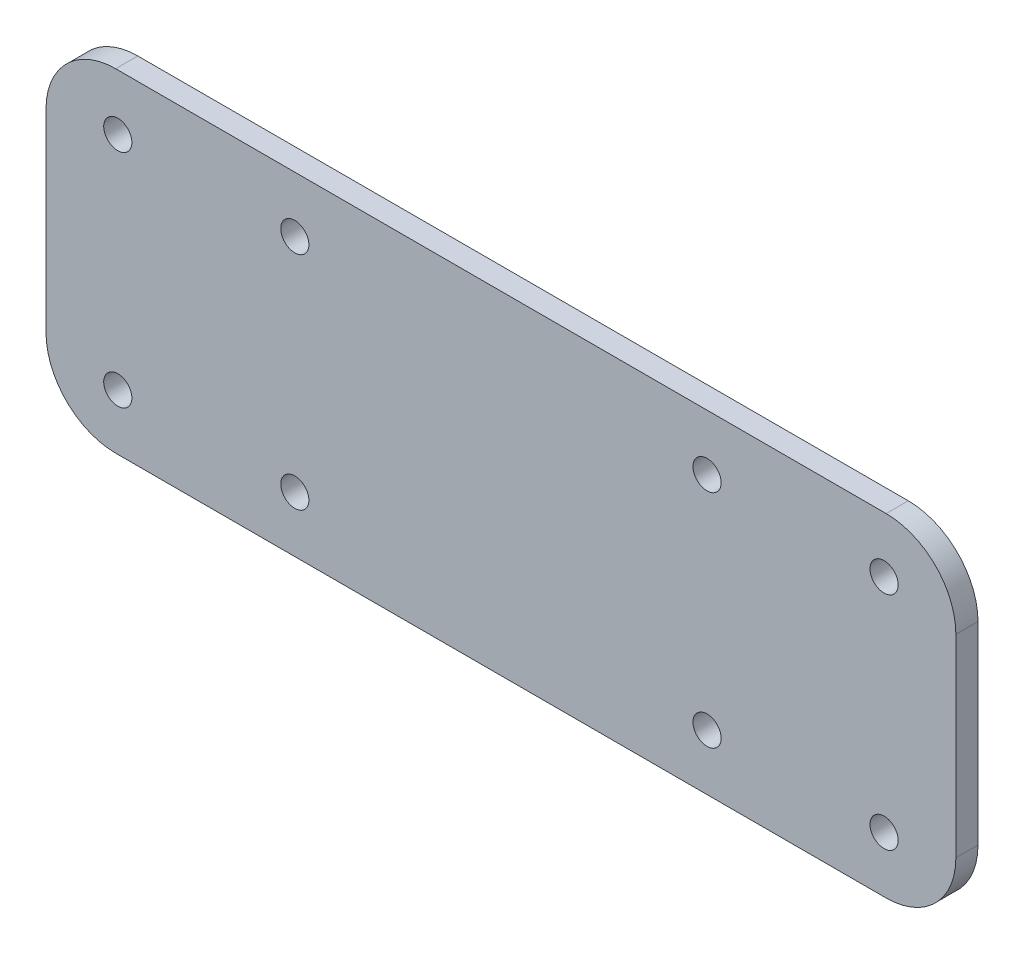
ISO-10303-21;
HEADER;
FILE_DESCRIPTION(('STEP AP214'),'2;1');
FILE_NAME('part.step','',(''),(''),'','','');
FILE_SCHEMA(('AUTOMOTIVE_DESIGN { 1 0 10303 214 1 1 1 1 }'));
ENDSEC;
DATA;
#1=APPLICATION_CONTEXT('core data for automotive mechanical design processes');
#2=APPLICATION_PROTOCOL_DEFINITION('international standard','automotive_design',2000,#1);
#3=PRODUCT_CONTEXT('',#1,'mechanical');
#4=PRODUCT('Part','Part','',(#3));
#5=PRODUCT_RELATED_PRODUCT_CATEGORY('part','',(#4));
#6=PRODUCT_DEFINITION_FORMATION('','',#4);
#7=PRODUCT_DEFINITION_CONTEXT('part definition',#1,'design');
#8=PRODUCT_DEFINITION('design','',#6,#7);
#9=PRODUCT_DEFINITION_SHAPE('','',#8);
#10=(LENGTH_UNIT() NAMED_UNIT(*) SI_UNIT(.MILLI.,.METRE.));
#11=(NAMED_UNIT(*) PLANE_ANGLE_UNIT() SI_UNIT($,.RADIAN.));
#12=(NAMED_UNIT(*) SI_UNIT($,.STERADIAN.) SOLID_ANGLE_UNIT());
#13=UNCERTAINTY_MEASURE_WITH_UNIT(LENGTH_MEASURE(1.E-05),#10,'distance_accuracy_value','');
#14=(GEOMETRIC_REPRESENTATION_CONTEXT(3) GLOBAL_UNCERTAINTY_ASSIGNED_CONTEXT((#13)) GLOBAL_UNIT_ASSIGNED_CONTEXT((#10,
#11,#12)) REPRESENTATION_CONTEXT('',''));
#15=CARTESIAN_POINT('',(0.,0.,0.));
#16=DIRECTION('',(0.,0.,1.));
#17=DIRECTION('',(1.,0.,0.));
#18=AXIS2_PLACEMENT_3D('',#15,#16,#17);
#19=CARTESIAN_POINT('',(157.634536959179,-46.40005,3.175));
#20=DIRECTION('',(0.,0.,-1.));
#21=DIRECTION('',(-1.,0.,0.));
#22=AXIS2_PLACEMENT_3D('',#19,#20,#21);
#23=CYLINDRICAL_SURFACE('',#22,2.0193);
#24=CARTESIAN_POINT('',(157.634536959179,-46.40005,3.175));
#25=DIRECTION('',(0.,0.,1.));
#26=DIRECTION('',(1.,0.,0.));
#27=AXIS2_PLACEMENT_3D('',#24,#25,#26);
#28=CIRCLE('',#27,2.0193);
#29=CARTESIAN_POINT('',(159.653836959179,-46.40005,3.175));
#30=VERTEX_POINT('',#29);
#31=EDGE_CURVE('E149',#30,#30,#28,.T.);
#32=ORIENTED_EDGE('',*,*,#31,.F.);
#33=EDGE_LOOP('',(#32));
#34=FACE_BOUND('',#33,.T.);
#35=CARTESIAN_POINT('',(157.634536959179,-46.40005,6.35));
#36=DIRECTION('',(0.,0.,1.));
#37=DIRECTION('',(1.,0.,0.));
#38=AXIS2_PLACEMENT_3D('',#35,#36,#37);
#39=CIRCLE('',#38,2.0193);
#40=CARTESIAN_POINT('',(159.653836959179,-46.40005,6.35));
#41=VERTEX_POINT('',#40);
#42=EDGE_CURVE('E119',#41,#41,#39,.F.);
#43=ORIENTED_EDGE('',*,*,#42,.F.);
#44=EDGE_LOOP('',(#43));
#45=FACE_BOUND('',#44,.T.);
#46=ADVANCED_FACE('F36',(#34,#45),#23,.F.);
#47=CARTESIAN_POINT('',(157.634536959179,-14.65005,3.175));
#48=DIRECTION('',(0.,0.,-1.));
#49=DIRECTION('',(-1.,0.,0.));
#50=AXIS2_PLACEMENT_3D('',#47,#48,#49);
#51=CYLINDRICAL_SURFACE('',#50,2.01929999999999);
#52=CARTESIAN_POINT('',(157.634536959179,-14.65005,3.175));
#53=DIRECTION('',(0.,0.,1.));
#54=DIRECTION('',(1.,0.,0.));
#55=AXIS2_PLACEMENT_3D('',#52,#53,#54);
#56=CIRCLE('',#55,2.01929999999999);
#57=CARTESIAN_POINT('',(159.653836959179,-14.65005,3.175));
#58=VERTEX_POINT('',#57);
#59=EDGE_CURVE('E209',#58,#58,#56,.T.);
#60=ORIENTED_EDGE('',*,*,#59,.F.);
#61=EDGE_LOOP('',(#60));
#62=FACE_BOUND('',#61,.T.);
#63=CARTESIAN_POINT('',(157.634536959179,-14.65005,6.35));
#64=DIRECTION('',(0.,0.,1.));
#65=DIRECTION('',(1.,0.,0.));
#66=AXIS2_PLACEMENT_3D('',#63,#64,#65);
#67=CIRCLE('',#66,2.01929999999999);
#68=CARTESIAN_POINT('',(159.653836959179,-14.65005,6.35));
#69=VERTEX_POINT('',#68);
#70=EDGE_CURVE('E137',#69,#69,#67,.F.);
#71=ORIENTED_EDGE('',*,*,#70,.F.);
#72=EDGE_LOOP('',(#71));
#73=FACE_BOUND('',#72,.T.);
#74=ADVANCED_FACE('F241',(#62,#73),#51,.F.);
#75=CARTESIAN_POINT('',(73.085367228118,-14.65005,3.175));
#76=DIRECTION('',(0.,0.,-1.));
#77=DIRECTION('',(-1.,0.,0.));
#78=AXIS2_PLACEMENT_3D('',#75,#76,#77);
#79=CYLINDRICAL_SURFACE('',#78,2.01929999999999);
#80=CARTESIAN_POINT('',(73.085367228118,-14.65005,3.175));
#81=DIRECTION('',(0.,0.,1.));
#82=DIRECTION('',(1.,0.,0.));
#83=AXIS2_PLACEMENT_3D('',#80,#81,#82);
#84=CIRCLE('',#83,2.01929999999999);
#85=CARTESIAN_POINT('',(75.104667228118,-14.65005,3.175));
#86=VERTEX_POINT('',#85);
#87=EDGE_CURVE('E206',#86,#86,#84,.T.);
#88=ORIENTED_EDGE('',*,*,#87,.F.);
#89=EDGE_LOOP('',(#88));
#90=FACE_BOUND('',#89,.T.);
#91=CARTESIAN_POINT('',(73.085367228118,-14.65005,6.35));
#92=DIRECTION('',(0.,0.,1.));
#93=DIRECTION('',(1.,0.,0.));
#94=AXIS2_PLACEMENT_3D('',#91,#92,#93);
#95=CIRCLE('',#94,2.01929999999999);
#96=CARTESIAN_POINT('',(75.104667228118,-14.65005,6.35));
#97=VERTEX_POINT('',#96);
#98=EDGE_CURVE('E140',#97,#97,#95,.F.);
#99=ORIENTED_EDGE('',*,*,#98,.F.);
#100=EDGE_LOOP('',(#99));
#101=FACE_BOUND('',#100,.T.);
#102=ADVANCED_FACE('F247',(#90,#101),#79,.F.);
#103=CARTESIAN_POINT('',(73.085367228118,-46.40005,3.175));
#104=DIRECTION('',(0.,0.,-1.));
#105=DIRECTION('',(-1.,0.,0.));
#106=AXIS2_PLACEMENT_3D('',#103,#104,#105);
#107=CYLINDRICAL_SURFACE('',#106,2.0193);
#108=CARTESIAN_POINT('',(73.085367228118,-46.40005,3.175));
#109=DIRECTION('',(0.,0.,1.));
#110=DIRECTION('',(1.,0.,0.));
#111=AXIS2_PLACEMENT_3D('',#108,#109,#110);
#112=CIRCLE('',#111,2.0193);
#113=CARTESIAN_POINT('',(75.104667228118,-46.40005,3.175));
#114=VERTEX_POINT('',#113);
#115=EDGE_CURVE('E203',#114,#114,#112,.T.);
#116=ORIENTED_EDGE('',*,*,#115,.F.);
#117=EDGE_LOOP('',(#116));
#118=FACE_BOUND('',#117,.T.);
#119=CARTESIAN_POINT('',(73.085367228118,-46.40005,6.35));
#120=DIRECTION('',(0.,0.,1.));
#121=DIRECTION('',(1.,0.,0.));
#122=AXIS2_PLACEMENT_3D('',#119,#120,#121);
#123=CIRCLE('',#122,2.0193);
#124=CARTESIAN_POINT('',(75.104667228118,-46.40005,6.35));
#125=VERTEX_POINT('',#124);
#126=EDGE_CURVE('E125',#125,#125,#123,.F.);
#127=ORIENTED_EDGE('',*,*,#126,.F.);
#128=EDGE_LOOP('',(#127));
#129=FACE_BOUND('',#128,.T.);
#130=ADVANCED_FACE('F258',(#118,#129),#107,.F.);
#131=CARTESIAN_POINT('',(47.685367228118,-46.40005,3.175));
#132=DIRECTION('',(0.,0.,-1.));
#133=DIRECTION('',(-1.,0.,0.));
#134=AXIS2_PLACEMENT_3D('',#131,#132,#133);
#135=CYLINDRICAL_SURFACE('',#134,2.01929999999999);
#136=CARTESIAN_POINT('',(47.685367228118,-46.40005,3.175));
#137=DIRECTION('',(0.,0.,1.));
#138=DIRECTION('',(1.,0.,0.));
#139=AXIS2_PLACEMENT_3D('',#136,#137,#138);
#140=CIRCLE('',#139,2.01929999999999);
#141=CARTESIAN_POINT('',(49.704667228118,-46.40005,3.175));
#142=VERTEX_POINT('',#141);
#143=EDGE_CURVE('E200',#142,#142,#140,.T.);
#144=ORIENTED_EDGE('',*,*,#143,.F.);
#145=EDGE_LOOP('',(#144));
#146=FACE_BOUND('',#145,.T.);
#147=CARTESIAN_POINT('',(47.685367228118,-46.40005,6.35));
#148=DIRECTION('',(0.,0.,1.));
#149=DIRECTION('',(1.,0.,0.));
#150=AXIS2_PLACEMENT_3D('',#147,#148,#149);
#151=CIRCLE('',#150,2.01929999999999);
#152=CARTESIAN_POINT('',(49.704667228118,-46.40005,6.35));
#153=VERTEX_POINT('',#152);
#154=EDGE_CURVE('E131',#153,#153,#151,.F.);
#155=ORIENTED_EDGE('',*,*,#154,.F.);
#156=EDGE_LOOP('',(#155));
#157=FACE_BOUND('',#156,.T.);
#158=ADVANCED_FACE('F262',(#146,#157),#135,.F.);
#159=CARTESIAN_POINT('',(47.685367228118,-14.65005,3.175));
#160=DIRECTION('',(0.,0.,-1.));
#161=DIRECTION('',(-1.,0.,0.));
#162=AXIS2_PLACEMENT_3D('',#159,#160,#161);
#163=CYLINDRICAL_SURFACE('',#162,2.01929999999999);
#164=CARTESIAN_POINT('',(47.685367228118,-14.65005,3.175));
#165=DIRECTION('',(0.,0.,1.));
#166=DIRECTION('',(1.,0.,0.));
#167=AXIS2_PLACEMENT_3D('',#164,#165,#166);
#168=CIRCLE('',#167,2.01929999999999);
#169=CARTESIAN_POINT('',(49.704667228118,-14.65005,3.175));
#170=VERTEX_POINT('',#169);
#171=EDGE_CURVE('E197',#170,#170,#168,.T.);
#172=ORIENTED_EDGE('',*,*,#171,.F.);
#173=EDGE_LOOP('',(#172));
#174=FACE_BOUND('',#173,.T.);
#175=CARTESIAN_POINT('',(47.685367228118,-14.65005,6.35));
#176=DIRECTION('',(0.,0.,1.));
#177=DIRECTION('',(1.,0.,0.));
#178=AXIS2_PLACEMENT_3D('',#175,#176,#177);
#179=CIRCLE('',#178,2.01929999999999);
#180=CARTESIAN_POINT('',(49.704667228118,-14.65005,6.35));
#181=VERTEX_POINT('',#180);
#182=EDGE_CURVE('E134',#181,#181,#179,.F.);
#183=ORIENTED_EDGE('',*,*,#182,.F.);
#184=EDGE_LOOP('',(#183));
#185=FACE_BOUND('',#184,.T.);
#186=ADVANCED_FACE('F266',(#174,#185),#163,.F.);
#187=CARTESIAN_POINT('',(132.234536959179,-14.65005,3.175));
#188=DIRECTION('',(0.,0.,-1.));
#189=DIRECTION('',(-1.,0.,0.));
#190=AXIS2_PLACEMENT_3D('',#187,#188,#189);
#191=CYLINDRICAL_SURFACE('',#190,2.01929999999999);
#192=CARTESIAN_POINT('',(132.234536959179,-14.65005,3.175));
#193=DIRECTION('',(0.,0.,1.));
#194=DIRECTION('',(1.,0.,0.));
#195=AXIS2_PLACEMENT_3D('',#192,#193,#194);
#196=CIRCLE('',#195,2.01929999999999);
#197=CARTESIAN_POINT('',(134.253836959179,-14.65005,3.175));
#198=VERTEX_POINT('',#197);
#199=EDGE_CURVE('E194',#198,#198,#196,.T.);
#200=ORIENTED_EDGE('',*,*,#199,.F.);
#201=EDGE_LOOP('',(#200));
#202=FACE_BOUND('',#201,.T.);
#203=CARTESIAN_POINT('',(132.234536959179,-14.65005,6.35));
#204=DIRECTION('',(0.,0.,1.));
#205=DIRECTION('',(1.,0.,0.));
#206=AXIS2_PLACEMENT_3D('',#203,#204,#205);
#207=CIRCLE('',#206,2.01929999999999);
#208=CARTESIAN_POINT('',(134.253836959179,-14.65005,6.35));
#209=VERTEX_POINT('',#208);
#210=EDGE_CURVE('E143',#209,#209,#207,.F.);
#211=ORIENTED_EDGE('',*,*,#210,.F.);
#212=EDGE_LOOP('',(#211));
#213=FACE_BOUND('',#212,.T.);
#214=ADVANCED_FACE('F270',(#202,#213),#191,.F.);
#215=CARTESIAN_POINT('',(132.234536959179,-46.40005,3.175));
#216=DIRECTION('',(0.,0.,-1.));
#217=DIRECTION('',(-1.,0.,0.));
#218=AXIS2_PLACEMENT_3D('',#215,#216,#217);
#219=CYLINDRICAL_SURFACE('',#218,2.01929999999999);
#220=CARTESIAN_POINT('',(132.234536959179,-46.40005,3.175));
#221=DIRECTION('',(0.,0.,1.));
#222=DIRECTION('',(1.,0.,0.));
#223=AXIS2_PLACEMENT_3D('',#220,#221,#222);
#224=CIRCLE('',#223,2.01929999999999);
#225=CARTESIAN_POINT('',(134.253836959179,-46.40005,3.175));
#226=VERTEX_POINT('',#225);
#227=EDGE_CURVE('E191',#226,#226,#224,.T.);
#228=ORIENTED_EDGE('',*,*,#227,.F.);
#229=EDGE_LOOP('',(#228));
#230=FACE_BOUND('',#229,.T.);
#231=CARTESIAN_POINT('',(132.234536959179,-46.40005,6.35));
#232=DIRECTION('',(0.,0.,1.));
#233=DIRECTION('',(1.,0.,0.));
#234=AXIS2_PLACEMENT_3D('',#231,#232,#233);
#235=CIRCLE('',#234,2.01929999999999);
#236=CARTESIAN_POINT('',(134.253836959179,-46.40005,6.35));
#237=VERTEX_POINT('',#236);
#238=EDGE_CURVE('E128',#237,#237,#235,.F.);
#239=ORIENTED_EDGE('',*,*,#238,.F.);
#240=EDGE_LOOP('',(#239));
#241=FACE_BOUND('',#240,.T.);
#242=ADVANCED_FACE('F274',(#230,#241),#219,.F.);
#243=CARTESIAN_POINT('',(37.385367228118,-15.8409228752538,-369.923299758246));
#244=DIRECTION('',(-1.,0.,0.));
#245=DIRECTION('',(0.,-1.,0.));
#246=AXIS2_PLACEMENT_3D('',#243,#244,#245);
#247=PLANE('',#246);
#248=DIRECTION('',(0.,-1.,0.));
#249=VECTOR('',#248,1.);
#250=CARTESIAN_POINT('',(37.385367228118,0.,3.175));
#251=LINE('',#250,#249);
#252=CARTESIAN_POINT('',(37.385367228118,-16.6390499999999,3.175));
#253=VERTEX_POINT('',#252);
#254=CARTESIAN_POINT('',(37.385367228118,-44.41105,3.175));
#255=VERTEX_POINT('',#254);
#256=EDGE_CURVE('E154',#253,#255,#251,.T.);
#257=ORIENTED_EDGE('',*,*,#256,.T.);
#258=DIRECTION('',(0.,0.,1.));
#259=VECTOR('',#258,1.);
#260=CARTESIAN_POINT('',(37.385367228118,-44.41105,-369.923299758246));
#261=LINE('',#260,#259);
#262=CARTESIAN_POINT('',(37.385367228118,-44.41105,6.35));
#263=VERTEX_POINT('',#262);
#264=EDGE_CURVE('E168',#255,#263,#261,.T.);
#265=ORIENTED_EDGE('',*,*,#264,.T.);
#266=DIRECTION('',(0.,-1.,0.));
#267=VECTOR('',#266,1.);
#268=CARTESIAN_POINT('',(37.385367228118,0.,6.35));
#269=LINE('',#268,#267);
#270=CARTESIAN_POINT('',(37.385367228118,-16.6390499999999,6.35));
#271=VERTEX_POINT('',#270);
#272=EDGE_CURVE('E113',#271,#263,#269,.T.);
#273=ORIENTED_EDGE('',*,*,#272,.F.);
#274=DIRECTION('',(0.,0.,-1.));
#275=VECTOR('',#274,1.);
#276=CARTESIAN_POINT('',(37.385367228118,-16.6390499999999,6.35));
#277=LINE('',#276,#275);
#278=EDGE_CURVE('E146',#271,#253,#277,.T.);
#279=ORIENTED_EDGE('',*,*,#278,.T.);
#280=EDGE_LOOP('',(#257,#265,#273,#279));
#281=FACE_BOUND('',#280,.T.);
#282=ADVANCED_FACE('F253',(#281),#247,.T.);
#283=CARTESIAN_POINT('',(37.385367228118,-54.41105,-369.923299758246));
#284=DIRECTION('',(0.,-1.,0.));
#285=DIRECTION('',(1.,0.,0.));
#286=AXIS2_PLACEMENT_3D('',#283,#284,#285);
#287=PLANE('',#286);
#288=DIRECTION('',(-1.,0.,0.));
#289=VECTOR('',#288,1.);
#290=CARTESIAN_POINT('',(167.934536959179,-54.41105,3.175));
#291=LINE('',#290,#289);
#292=CARTESIAN_POINT('',(157.934536959179,-54.41105,3.175));
#293=VERTEX_POINT('',#292);
#294=CARTESIAN_POINT('',(47.385367228118,-54.41105,3.175));
#295=VERTEX_POINT('',#294);
#296=EDGE_CURVE('E182',#293,#295,#291,.T.);
#297=ORIENTED_EDGE('',*,*,#296,.F.);
#298=DIRECTION('',(0.,0.,1.));
#299=VECTOR('',#298,1.);
#300=CARTESIAN_POINT('',(157.934536959179,-54.41105,-369.923299758246));
#301=LINE('',#300,#299);
#302=CARTESIAN_POINT('',(157.934536959179,-54.41105,6.35));
#303=VERTEX_POINT('',#302);
#304=EDGE_CURVE('E11',#293,#303,#301,.T.);
#305=ORIENTED_EDGE('',*,*,#304,.T.);
#306=DIRECTION('',(1.,0.,0.));
#307=VECTOR('',#306,1.);
#308=CARTESIAN_POINT('',(0.,-54.41105,6.35));
#309=LINE('',#308,#307);
#310=CARTESIAN_POINT('',(47.385367228118,-54.41105,6.35));
#311=VERTEX_POINT('',#310);
#312=EDGE_CURVE('E110',#311,#303,#309,.T.);
#313=ORIENTED_EDGE('',*,*,#312,.F.);
#314=DIRECTION('',(0.,0.,1.));
#315=VECTOR('',#314,1.);
#316=CARTESIAN_POINT('',(47.385367228118,-54.41105,-369.923299758246));
#317=LINE('',#316,#315);
#318=EDGE_CURVE('E45',#311,#295,#317,.F.);
#319=ORIENTED_EDGE('',*,*,#318,.T.);
#320=EDGE_LOOP('',(#297,#305,#313,#319));
#321=FACE_BOUND('',#320,.T.);
#322=ADVANCED_FACE('F115',(#321),#287,.T.);
#323=CARTESIAN_POINT('',(167.934536959179,-54.41105,-369.923299758246));
#324=DIRECTION('',(1.,0.,0.));
#325=DIRECTION('',(0.,0.,-1.));
#326=AXIS2_PLACEMENT_3D('',#323,#324,#325);
#327=PLANE('',#326);
#328=DIRECTION('',(0.,0.,1.));
#329=VECTOR('',#328,1.);
#330=CARTESIAN_POINT('',(167.934536959179,-44.41105,-369.923299758246));
#331=LINE('',#330,#329);
#332=CARTESIAN_POINT('',(167.934536959179,-44.41105,6.35));
#333=VERTEX_POINT('',#332);
#334=CARTESIAN_POINT('',(167.934536959179,-44.41105,3.175));
#335=VERTEX_POINT('',#334);
#336=EDGE_CURVE('E53',#333,#335,#331,.F.);
#337=ORIENTED_EDGE('',*,*,#336,.T.);
#338=DIRECTION('',(0.,1.,0.));
#339=VECTOR('',#338,1.);
#340=CARTESIAN_POINT('',(167.934536959179,0.,3.175));
#341=LINE('',#340,#339);
#342=CARTESIAN_POINT('',(167.934536959179,-16.6390499999999,3.175));
#343=VERTEX_POINT('',#342);
#344=EDGE_CURVE('E147',#335,#343,#341,.T.);
#345=ORIENTED_EDGE('',*,*,#344,.T.);
#346=DIRECTION('',(0.,0.,-1.));
#347=VECTOR('',#346,1.);
#348=CARTESIAN_POINT('',(167.934536959179,-16.6390499999999,6.35));
#349=LINE('',#348,#347);
#350=CARTESIAN_POINT('',(167.934536959179,-16.6390499999999,6.35));
#351=VERTEX_POINT('',#350);
#352=EDGE_CURVE('E165',#351,#343,#349,.T.);
#353=ORIENTED_EDGE('',*,*,#352,.F.);
#354=DIRECTION('',(0.,1.,0.));
#355=VECTOR('',#354,1.);
#356=CARTESIAN_POINT('',(167.934536959179,0.,6.35));
#357=LINE('',#356,#355);
#358=EDGE_CURVE('E157',#333,#351,#357,.T.);
#359=ORIENTED_EDGE('',*,*,#358,.F.);
#360=EDGE_LOOP('',(#337,#345,#353,#359));
#361=FACE_BOUND('',#360,.T.);
#362=ADVANCED_FACE('F173',(#361),#327,.T.);
#363=CARTESIAN_POINT('',(157.934536959179,-44.41105,-369.923299758246));
#364=DIRECTION('',(0.,0.,1.));
#365=DIRECTION('',(1.,0.,0.));
#366=AXIS2_PLACEMENT_3D('',#363,#364,#365);
#367=CYLINDRICAL_SURFACE('',#366,10.);
#368=CARTESIAN_POINT('',(157.934536959179,-44.41105,3.17499999999998));
#369=DIRECTION('',(0.,0.,1.));
#370=DIRECTION('',(1.,0.,0.));
#371=AXIS2_PLACEMENT_3D('',#368,#369,#370);
#372=CIRCLE('',#371,10.);
#373=EDGE_CURVE('E186',#335,#293,#372,.F.);
#374=ORIENTED_EDGE('',*,*,#373,.F.);
#375=ORIENTED_EDGE('',*,*,#336,.F.);
#376=CARTESIAN_POINT('',(157.934536959179,-44.41105,6.35));
#377=DIRECTION('',(0.,0.,1.));
#378=DIRECTION('',(1.,0.,0.));
#379=AXIS2_PLACEMENT_3D('',#376,#377,#378);
#380=CIRCLE('',#379,10.);
#381=EDGE_CURVE('E117',#303,#333,#380,.T.);
#382=ORIENTED_EDGE('',*,*,#381,.F.);
#383=ORIENTED_EDGE('',*,*,#304,.F.);
#384=EDGE_LOOP('',(#374,#375,#382,#383));
#385=FACE_BOUND('',#384,.T.);
#386=ADVANCED_FACE('F278',(#385),#367,.T.);
#387=CARTESIAN_POINT('',(47.385367228118,-44.41105,-369.923299758246));
#388=DIRECTION('',(0.,0.,1.));
#389=DIRECTION('',(1.,0.,0.));
#390=AXIS2_PLACEMENT_3D('',#387,#388,#389);
#391=CYLINDRICAL_SURFACE('',#390,10.);
#392=CARTESIAN_POINT('',(47.385367228118,-44.41105,3.17499999999998));
#393=DIRECTION('',(0.,0.,1.));
#394=DIRECTION('',(1.,0.,0.));
#395=AXIS2_PLACEMENT_3D('',#392,#393,#394);
#396=CIRCLE('',#395,10.);
#397=EDGE_CURVE('E101',#295,#255,#396,.F.);
#398=ORIENTED_EDGE('',*,*,#397,.F.);
#399=ORIENTED_EDGE('',*,*,#318,.F.);
#400=CARTESIAN_POINT('',(47.385367228118,-44.41105,6.35));
#401=DIRECTION('',(0.,0.,1.));
#402=DIRECTION('',(1.,0.,0.));
#403=AXIS2_PLACEMENT_3D('',#400,#401,#402);
#404=CIRCLE('',#403,10.);
#405=EDGE_CURVE('E99',#263,#311,#404,.T.);
#406=ORIENTED_EDGE('',*,*,#405,.F.);
#407=ORIENTED_EDGE('',*,*,#264,.F.);
#408=EDGE_LOOP('',(#398,#399,#406,#407));
#409=FACE_BOUND('',#408,.T.);
#410=ADVANCED_FACE('F38',(#409),#391,.T.);
#411=CARTESIAN_POINT('',(0.,0.,3.175));
#412=DIRECTION('',(0.,0.,1.));
#413=DIRECTION('',(1.,0.,0.));
#414=AXIS2_PLACEMENT_3D('',#411,#412,#413);
#415=PLANE('',#414);
#416=CARTESIAN_POINT('',(157.934536959179,-16.6390499999999,3.175));
#417=DIRECTION('',(0.,0.,1.));
#418=DIRECTION('',(1.,0.,0.));
#419=AXIS2_PLACEMENT_3D('',#416,#417,#418);
#420=CIRCLE('',#419,10.);
#421=CARTESIAN_POINT('',(157.934536959179,-6.63904999999995,3.175));
#422=VERTEX_POINT('',#421);
#423=EDGE_CURVE('E65',#422,#343,#420,.F.);
#424=ORIENTED_EDGE('',*,*,#423,.T.);
#425=ORIENTED_EDGE('',*,*,#344,.F.);
#426=ORIENTED_EDGE('',*,*,#373,.T.);
#427=ORIENTED_EDGE('',*,*,#296,.T.);
#428=ORIENTED_EDGE('',*,*,#397,.T.);
#429=ORIENTED_EDGE('',*,*,#256,.F.);
#430=CARTESIAN_POINT('',(47.385367228118,-16.6390499999999,3.175));
#431=DIRECTION('',(0.,0.,1.));
#432=DIRECTION('',(1.,0.,0.));
#433=AXIS2_PLACEMENT_3D('',#430,#431,#432);
#434=CIRCLE('',#433,10.);
#435=CARTESIAN_POINT('',(47.385367228118,-6.63904999999994,3.175));
#436=VERTEX_POINT('',#435);
#437=EDGE_CURVE('E152',#253,#436,#434,.F.);
#438=ORIENTED_EDGE('',*,*,#437,.T.);
#439=DIRECTION('',(1.,0.,0.));
#440=VECTOR('',#439,1.);
#441=CARTESIAN_POINT('',(0.,-6.63904999999994,3.175));
#442=LINE('',#441,#440);
#443=EDGE_CURVE('E73',#436,#422,#442,.T.);
#444=ORIENTED_EDGE('',*,*,#443,.T.);
#445=EDGE_LOOP('',(#424,#425,#426,#427,#428,#429,#438,#444));
#446=FACE_BOUND('',#445,.T.);
#447=ORIENTED_EDGE('',*,*,#31,.T.);
#448=EDGE_LOOP('',(#447));
#449=FACE_BOUND('',#448,.T.);
#450=ORIENTED_EDGE('',*,*,#59,.T.);
#451=EDGE_LOOP('',(#450));
#452=FACE_BOUND('',#451,.T.);
#453=ORIENTED_EDGE('',*,*,#87,.T.);
#454=EDGE_LOOP('',(#453));
#455=FACE_BOUND('',#454,.T.);
#456=ORIENTED_EDGE('',*,*,#115,.T.);
#457=EDGE_LOOP('',(#456));
#458=FACE_BOUND('',#457,.T.);
#459=ORIENTED_EDGE('',*,*,#143,.T.);
#460=EDGE_LOOP('',(#459));
#461=FACE_BOUND('',#460,.T.);
#462=ORIENTED_EDGE('',*,*,#171,.T.);
#463=EDGE_LOOP('',(#462));
#464=FACE_BOUND('',#463,.T.);
#465=ORIENTED_EDGE('',*,*,#199,.T.);
#466=EDGE_LOOP('',(#465));
#467=FACE_BOUND('',#466,.T.);
#468=ORIENTED_EDGE('',*,*,#227,.T.);
#469=EDGE_LOOP('',(#468));
#470=FACE_BOUND('',#469,.T.);
#471=ADVANCED_FACE('F183',(#446,#449,#452,#455,#458,#461,#464,#467,#470),#415,.F.);
#472=CARTESIAN_POINT('',(157.934536959179,-16.6390499999999,6.35));
#473=DIRECTION('',(0.,0.,-1.));
#474=DIRECTION('',(-1.,0.,0.));
#475=AXIS2_PLACEMENT_3D('',#472,#473,#474);
#476=CYLINDRICAL_SURFACE('',#475,10.);
#477=ORIENTED_EDGE('',*,*,#423,.F.);
#478=DIRECTION('',(0.,0.,-1.));
#479=VECTOR('',#478,1.);
#480=CARTESIAN_POINT('',(157.934536959179,-6.63904999999995,6.35));
#481=LINE('',#480,#479);
#482=CARTESIAN_POINT('',(157.934536959179,-6.63904999999995,6.35));
#483=VERTEX_POINT('',#482);
#484=EDGE_CURVE('E163',#483,#422,#481,.T.);
#485=ORIENTED_EDGE('',*,*,#484,.F.);
#486=CARTESIAN_POINT('',(157.934536959179,-16.6390499999999,6.35));
#487=DIRECTION('',(0.,0.,1.));
#488=DIRECTION('',(1.,0.,0.));
#489=AXIS2_PLACEMENT_3D('',#486,#487,#488);
#490=CIRCLE('',#489,10.);
#491=EDGE_CURVE('E215',#483,#351,#490,.F.);
#492=ORIENTED_EDGE('',*,*,#491,.T.);
#493=ORIENTED_EDGE('',*,*,#352,.T.);
#494=EDGE_LOOP('',(#477,#485,#492,#493));
#495=FACE_BOUND('',#494,.T.);
#496=ADVANCED_FACE('F230',(#495),#476,.T.);
#497=CARTESIAN_POINT('',(0.,-6.63904999999994,6.35));
#498=DIRECTION('',(0.,1.,0.));
#499=DIRECTION('',(-1.,0.,0.));
#500=AXIS2_PLACEMENT_3D('',#497,#498,#499);
#501=PLANE('',#500);
#502=ORIENTED_EDGE('',*,*,#443,.F.);
#503=DIRECTION('',(0.,0.,-1.));
#504=VECTOR('',#503,1.);
#505=CARTESIAN_POINT('',(47.385367228118,-6.63904999999994,6.35));
#506=LINE('',#505,#504);
#507=CARTESIAN_POINT('',(47.385367228118,-6.63904999999994,6.35));
#508=VERTEX_POINT('',#507);
#509=EDGE_CURVE('E160',#508,#436,#506,.T.);
#510=ORIENTED_EDGE('',*,*,#509,.F.);
#511=DIRECTION('',(1.,0.,0.));
#512=VECTOR('',#511,1.);
#513=CARTESIAN_POINT('',(0.,-6.63904999999994,6.35));
#514=LINE('',#513,#512);
#515=EDGE_CURVE('E218',#508,#483,#514,.T.);
#516=ORIENTED_EDGE('',*,*,#515,.T.);
#517=ORIENTED_EDGE('',*,*,#484,.T.);
#518=EDGE_LOOP('',(#502,#510,#516,#517));
#519=FACE_BOUND('',#518,.T.);
#520=ADVANCED_FACE('F228',(#519),#501,.T.);
#521=CARTESIAN_POINT('',(47.385367228118,-16.6390499999999,6.35));
#522=DIRECTION('',(0.,0.,-1.));
#523=DIRECTION('',(-1.,0.,0.));
#524=AXIS2_PLACEMENT_3D('',#521,#522,#523);
#525=CYLINDRICAL_SURFACE('',#524,10.);
#526=ORIENTED_EDGE('',*,*,#437,.F.);
#527=ORIENTED_EDGE('',*,*,#278,.F.);
#528=CARTESIAN_POINT('',(47.385367228118,-16.6390499999999,6.35));
#529=DIRECTION('',(0.,0.,1.));
#530=DIRECTION('',(1.,0.,0.));
#531=AXIS2_PLACEMENT_3D('',#528,#529,#530);
#532=CIRCLE('',#531,10.);
#533=EDGE_CURVE('E221',#271,#508,#532,.F.);
#534=ORIENTED_EDGE('',*,*,#533,.T.);
#535=ORIENTED_EDGE('',*,*,#509,.T.);
#536=EDGE_LOOP('',(#526,#527,#534,#535));
#537=FACE_BOUND('',#536,.T.);
#538=ADVANCED_FACE('F224',(#537),#525,.T.);
#539=CARTESIAN_POINT('',(0.,0.,6.35));
#540=DIRECTION('',(0.,0.,1.));
#541=DIRECTION('',(1.,0.,0.));
#542=AXIS2_PLACEMENT_3D('',#539,#540,#541);
#543=PLANE('',#542);
#544=ORIENTED_EDGE('',*,*,#358,.T.);
#545=ORIENTED_EDGE('',*,*,#491,.F.);
#546=ORIENTED_EDGE('',*,*,#515,.F.);
#547=ORIENTED_EDGE('',*,*,#533,.F.);
#548=ORIENTED_EDGE('',*,*,#272,.T.);
#549=ORIENTED_EDGE('',*,*,#405,.T.);
#550=ORIENTED_EDGE('',*,*,#312,.T.);
#551=ORIENTED_EDGE('',*,*,#381,.T.);
#552=EDGE_LOOP('',(#544,#545,#546,#547,#548,#549,#550,#551));
#553=FACE_BOUND('',#552,.T.);
#554=ORIENTED_EDGE('',*,*,#42,.T.);
#555=EDGE_LOOP('',(#554));
#556=FACE_BOUND('',#555,.T.);
#557=ORIENTED_EDGE('',*,*,#126,.T.);
#558=EDGE_LOOP('',(#557));
#559=FACE_BOUND('',#558,.T.);
#560=ORIENTED_EDGE('',*,*,#238,.T.);
#561=EDGE_LOOP('',(#560));
#562=FACE_BOUND('',#561,.T.);
#563=ORIENTED_EDGE('',*,*,#154,.T.);
#564=EDGE_LOOP('',(#563));
#565=FACE_BOUND('',#564,.T.);
#566=ORIENTED_EDGE('',*,*,#182,.T.);
#567=EDGE_LOOP('',(#566));
#568=FACE_BOUND('',#567,.T.);
#569=ORIENTED_EDGE('',*,*,#70,.T.);
#570=EDGE_LOOP('',(#569));
#571=FACE_BOUND('',#570,.T.);
#572=ORIENTED_EDGE('',*,*,#98,.T.);
#573=EDGE_LOOP('',(#572));
#574=FACE_BOUND('',#573,.T.);
#575=ORIENTED_EDGE('',*,*,#210,.T.);
#576=EDGE_LOOP('',(#575));
#577=FACE_BOUND('',#576,.T.);
#578=ADVANCED_FACE('F108',(#553,#556,#559,#562,#565,#568,#571,#574,#577),#543,.T.);
#579=CLOSED_SHELL('',(#46,#74,#102,#130,#158,#186,#214,#242,#282,#322,#362,#386,#410,#471,#496,
#520,#538,#578));
#580=MANIFOLD_SOLID_BREP('B2',#579);
#581=ADVANCED_BREP_SHAPE_REPRESENTATION('',(#18,#580),#14);
#582=SHAPE_DEFINITION_REPRESENTATION(#9,#581);
ENDSEC;
END-ISO-10303-21;
